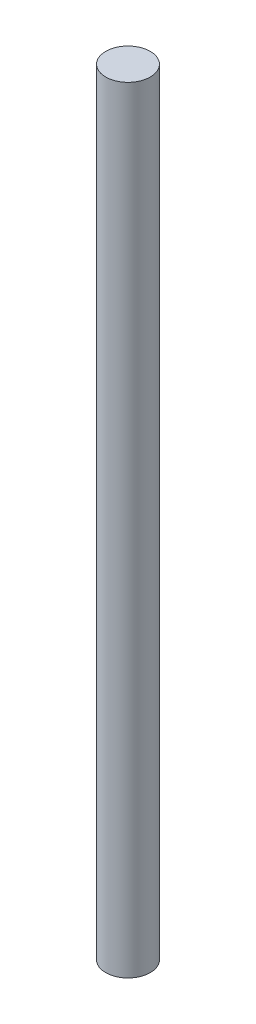
ISO-10303-21;
HEADER;
FILE_DESCRIPTION(('STEP AP214'),'2;1');
FILE_NAME('part.step','',(''),(''),'','','');
FILE_SCHEMA(('AUTOMOTIVE_DESIGN { 1 0 10303 214 1 1 1 1 }'));
ENDSEC;
DATA;
#1=APPLICATION_CONTEXT('core data for automotive mechanical design processes');
#2=APPLICATION_PROTOCOL_DEFINITION('international standard','automotive_design',2000,#1);
#3=PRODUCT_CONTEXT('',#1,'mechanical');
#4=PRODUCT('Part','Part','',(#3));
#5=PRODUCT_RELATED_PRODUCT_CATEGORY('part','',(#4));
#6=PRODUCT_DEFINITION_FORMATION('','',#4);
#7=PRODUCT_DEFINITION_CONTEXT('part definition',#1,'design');
#8=PRODUCT_DEFINITION('design','',#6,#7);
#9=PRODUCT_DEFINITION_SHAPE('','',#8);
#10=(LENGTH_UNIT() NAMED_UNIT(*) SI_UNIT(.MILLI.,.METRE.));
#11=(NAMED_UNIT(*) PLANE_ANGLE_UNIT() SI_UNIT($,.RADIAN.));
#12=(NAMED_UNIT(*) SI_UNIT($,.STERADIAN.) SOLID_ANGLE_UNIT());
#13=UNCERTAINTY_MEASURE_WITH_UNIT(LENGTH_MEASURE(1.E-05),#10,'distance_accuracy_value','');
#14=(GEOMETRIC_REPRESENTATION_CONTEXT(3) GLOBAL_UNCERTAINTY_ASSIGNED_CONTEXT((#13)) GLOBAL_UNIT_ASSIGNED_CONTEXT((#10,
#11,#12)) REPRESENTATION_CONTEXT('',''));
#15=CARTESIAN_POINT('',(0.,0.,0.));
#16=DIRECTION('',(0.,0.,1.));
#17=DIRECTION('',(1.,0.,0.));
#18=AXIS2_PLACEMENT_3D('',#15,#16,#17);
#19=CARTESIAN_POINT('',(0.,54.,0.));
#20=DIRECTION('',(0.,-1.,0.));
#21=DIRECTION('',(0.,0.,-1.));
#22=AXIS2_PLACEMENT_3D('',#19,#20,#21);
#23=CYLINDRICAL_SURFACE('',#22,1.55);
#24=CARTESIAN_POINT('',(0.,54.,0.));
#25=DIRECTION('',(0.,1.,0.));
#26=DIRECTION('',(0.,0.,1.));
#27=AXIS2_PLACEMENT_3D('',#24,#25,#26);
#28=CIRCLE('',#27,1.55);
#29=CARTESIAN_POINT('',(0.,54.,1.55));
#30=VERTEX_POINT('',#29);
#31=EDGE_CURVE('E10',#30,#30,#28,.T.);
#32=ORIENTED_EDGE('',*,*,#31,.F.);
#33=EDGE_LOOP('',(#32));
#34=FACE_BOUND('',#33,.T.);
#35=CARTESIAN_POINT('',(0.,0.,0.));
#36=DIRECTION('',(0.,1.,0.));
#37=DIRECTION('',(0.,0.,1.));
#38=AXIS2_PLACEMENT_3D('',#35,#36,#37);
#39=CIRCLE('',#38,1.55);
#40=CARTESIAN_POINT('',(0.,0.,1.55));
#41=VERTEX_POINT('',#40);
#42=EDGE_CURVE('E34',#41,#41,#39,.T.);
#43=ORIENTED_EDGE('',*,*,#42,.T.);
#44=EDGE_LOOP('',(#43));
#45=FACE_BOUND('',#44,.T.);
#46=ADVANCED_FACE('F31',(#34,#45),#23,.T.);
#47=CARTESIAN_POINT('',(0.,54.,0.));
#48=DIRECTION('',(0.,1.,0.));
#49=DIRECTION('',(0.,0.,1.));
#50=AXIS2_PLACEMENT_3D('',#47,#48,#49);
#51=PLANE('',#50);
#52=ORIENTED_EDGE('',*,*,#31,.T.);
#53=EDGE_LOOP('',(#52));
#54=FACE_BOUND('',#53,.T.);
#55=ADVANCED_FACE('F46',(#54),#51,.T.);
#56=CARTESIAN_POINT('',(0.,0.,0.));
#57=DIRECTION('',(0.,1.,0.));
#58=DIRECTION('',(0.,0.,1.));
#59=AXIS2_PLACEMENT_3D('',#56,#57,#58);
#60=PLANE('',#59);
#61=ORIENTED_EDGE('',*,*,#42,.F.);
#62=EDGE_LOOP('',(#61));
#63=FACE_BOUND('',#62,.T.);
#64=ADVANCED_FACE('F44',(#63),#60,.F.);
#65=CLOSED_SHELL('',(#46,#55,#64));
#66=MANIFOLD_SOLID_BREP('B2',#65);
#67=ADVANCED_BREP_SHAPE_REPRESENTATION('',(#18,#66),#14);
#68=SHAPE_DEFINITION_REPRESENTATION(#9,#67);
ENDSEC;
END-ISO-10303-21;
